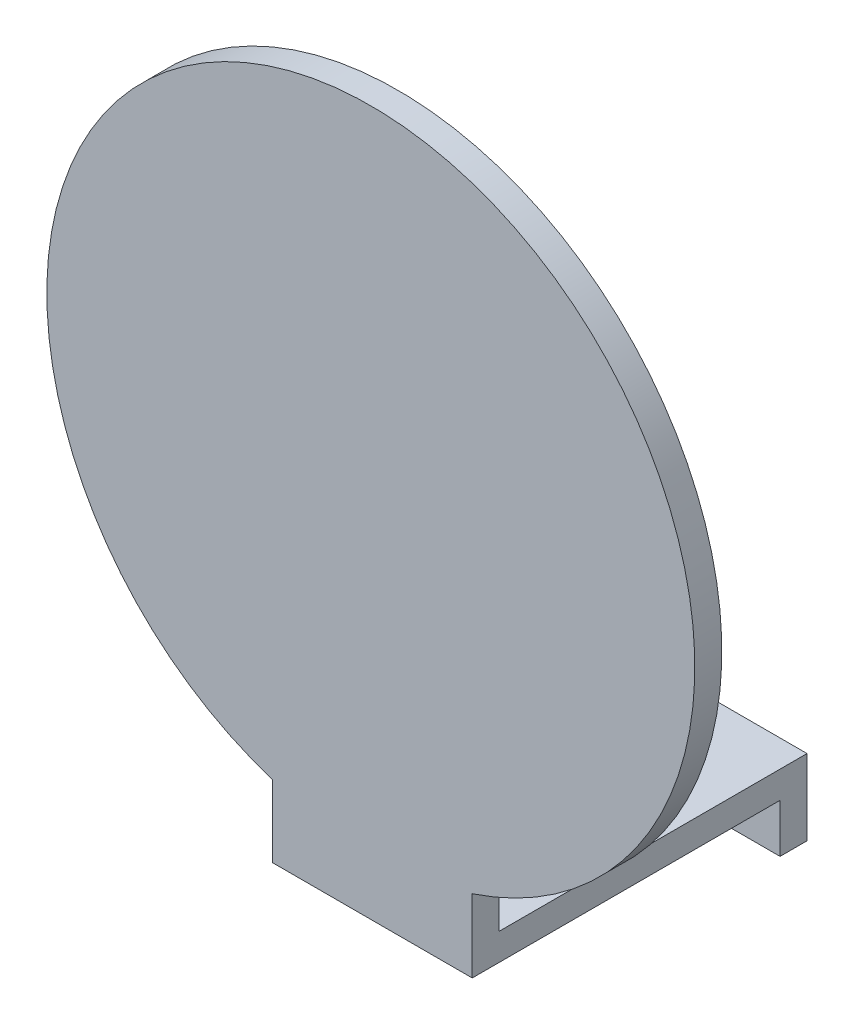
ISO-10303-21;
HEADER;
FILE_DESCRIPTION(('STEP AP214'),'2;1');
FILE_NAME('part.step','',(''),(''),'','','');
FILE_SCHEMA(('AUTOMOTIVE_DESIGN { 1 0 10303 214 1 1 1 1 }'));
ENDSEC;
DATA;
#1=APPLICATION_CONTEXT('core data for automotive mechanical design processes');
#2=APPLICATION_PROTOCOL_DEFINITION('international standard','automotive_design',2000,#1);
#3=PRODUCT_CONTEXT('',#1,'mechanical');
#4=PRODUCT('Part','Part','',(#3));
#5=PRODUCT_RELATED_PRODUCT_CATEGORY('part','',(#4));
#6=PRODUCT_DEFINITION_FORMATION('','',#4);
#7=PRODUCT_DEFINITION_CONTEXT('part definition',#1,'design');
#8=PRODUCT_DEFINITION('design','',#6,#7);
#9=PRODUCT_DEFINITION_SHAPE('','',#8);
#10=(LENGTH_UNIT() NAMED_UNIT(*) SI_UNIT(.MILLI.,.METRE.));
#11=(NAMED_UNIT(*) PLANE_ANGLE_UNIT() SI_UNIT($,.RADIAN.));
#12=(NAMED_UNIT(*) SI_UNIT($,.STERADIAN.) SOLID_ANGLE_UNIT());
#13=UNCERTAINTY_MEASURE_WITH_UNIT(LENGTH_MEASURE(1.E-05),#10,'distance_accuracy_value','');
#14=(GEOMETRIC_REPRESENTATION_CONTEXT(3) GLOBAL_UNCERTAINTY_ASSIGNED_CONTEXT((#13)) GLOBAL_UNIT_ASSIGNED_CONTEXT((#10,
#11,#12)) REPRESENTATION_CONTEXT('',''));
#15=CARTESIAN_POINT('',(0.,0.,0.));
#16=DIRECTION('',(0.,0.,1.));
#17=DIRECTION('',(1.,0.,0.));
#18=AXIS2_PLACEMENT_3D('',#15,#16,#17);
#19=CARTESIAN_POINT('',(0.,0.,-2342.01832557801));
#20=DIRECTION('',(0.,0.,1.));
#21=DIRECTION('',(1.,0.,0.));
#22=AXIS2_PLACEMENT_3D('',#19,#20,#21);
#23=PLANE('',#22);
#24=DIRECTION('',(1.,0.,0.));
#25=VECTOR('',#24,1.);
#26=CARTESIAN_POINT('',(18.4999999999997,6.00000000000043,-2342.01832557801));
#27=LINE('',#26,#25);
#28=CARTESIAN_POINT('',(-18.5000000000004,6.00000000000043,-2342.01832557801));
#29=VERTEX_POINT('',#28);
#30=CARTESIAN_POINT('',(18.4999999999997,6.00000000000043,-2342.01832557801));
#31=VERTEX_POINT('',#30);
#32=EDGE_CURVE('E125',#29,#31,#27,.T.);
#33=ORIENTED_EDGE('',*,*,#32,.F.);
#34=DIRECTION('',(0.,-1.,0.));
#35=VECTOR('',#34,1.);
#36=CARTESIAN_POINT('',(-18.5000000000004,5.00000000000019,-2342.01832557801));
#37=LINE('',#36,#35);
#38=CARTESIAN_POINT('',(-18.5000000000004,-2.99999999999977,-2342.01832557801));
#39=VERTEX_POINT('',#38);
#40=EDGE_CURVE('E154',#29,#39,#37,.T.);
#41=ORIENTED_EDGE('',*,*,#40,.T.);
#42=DIRECTION('',(1.,0.,0.));
#43=VECTOR('',#42,1.);
#44=CARTESIAN_POINT('',(-18.5000000000004,-2.99999999999977,-2342.01832557801));
#45=LINE('',#44,#43);
#46=CARTESIAN_POINT('',(18.4999999999996,-2.99999999999977,-2342.01832557801));
#47=VERTEX_POINT('',#46);
#48=EDGE_CURVE('E156',#39,#47,#45,.T.);
#49=ORIENTED_EDGE('',*,*,#48,.T.);
#50=DIRECTION('',(0.,1.,0.));
#51=VECTOR('',#50,1.);
#52=CARTESIAN_POINT('',(18.4999999999996,5.00000000000019,-2342.01832557801));
#53=LINE('',#52,#51);
#54=EDGE_CURVE('E159',#47,#31,#53,.T.);
#55=ORIENTED_EDGE('',*,*,#54,.T.);
#56=EDGE_LOOP('',(#33,#41,#49,#55));
#57=FACE_BOUND('',#56,.T.);
#58=CARTESIAN_POINT('',(9.99999999999957,1.0000000000002,-2342.01832557801));
#59=DIRECTION('',(0.,0.,1.));
#60=DIRECTION('',(1.,0.,0.));
#61=AXIS2_PLACEMENT_3D('',#58,#59,#60);
#62=CIRCLE('',#61,2.1);
#63=CARTESIAN_POINT('',(12.0999999999996,1.0000000000002,-2342.01832557801));
#64=VERTEX_POINT('',#63);
#65=EDGE_CURVE('E148',#64,#64,#62,.T.);
#66=ORIENTED_EDGE('',*,*,#65,.F.);
#67=EDGE_LOOP('',(#66));
#68=FACE_BOUND('',#67,.T.);
#69=CARTESIAN_POINT('',(-10.0000000000004,1.00000000000023,-2342.01832557801));
#70=DIRECTION('',(0.,0.,1.));
#71=DIRECTION('',(1.,0.,0.));
#72=AXIS2_PLACEMENT_3D('',#69,#70,#71);
#73=CIRCLE('',#72,2.1);
#74=CARTESIAN_POINT('',(-7.90000000000042,1.00000000000023,-2342.01832557801));
#75=VERTEX_POINT('',#74);
#76=EDGE_CURVE('E142',#75,#75,#73,.T.);
#77=ORIENTED_EDGE('',*,*,#76,.F.);
#78=EDGE_LOOP('',(#77));
#79=FACE_BOUND('',#78,.T.);
#80=ADVANCED_FACE('F33',(#57,#68,#79),#23,.T.);
#81=CARTESIAN_POINT('',(0.,0.,-2347.01832557801));
#82=DIRECTION('',(0.,0.,1.));
#83=DIRECTION('',(1.,0.,0.));
#84=AXIS2_PLACEMENT_3D('',#81,#82,#83);
#85=PLANE('',#84);
#86=DIRECTION('',(0.,-1.,0.));
#87=VECTOR('',#86,1.);
#88=CARTESIAN_POINT('',(-18.5000000000004,5.00000000000019,-2347.01832557801));
#89=LINE('',#88,#87);
#90=CARTESIAN_POINT('',(-18.5000000000004,11.0000000000002,-2347.01832557801));
#91=VERTEX_POINT('',#90);
#92=CARTESIAN_POINT('',(-18.5000000000004,-2.99999999999977,-2347.01832557801));
#93=VERTEX_POINT('',#92);
#94=EDGE_CURVE('E151',#91,#93,#89,.T.);
#95=ORIENTED_EDGE('',*,*,#94,.F.);
#96=DIRECTION('',(-1.,0.,0.));
#97=VECTOR('',#96,1.);
#98=CARTESIAN_POINT('',(18.4999999999996,11.0000000000002,-2347.01832557801));
#99=LINE('',#98,#97);
#100=CARTESIAN_POINT('',(18.4999999999996,11.0000000000002,-2347.01832557801));
#101=VERTEX_POINT('',#100);
#102=EDGE_CURVE('E116',#101,#91,#99,.T.);
#103=ORIENTED_EDGE('',*,*,#102,.F.);
#104=DIRECTION('',(0.,1.,0.));
#105=VECTOR('',#104,1.);
#106=CARTESIAN_POINT('',(18.4999999999996,5.00000000000019,-2347.01832557801));
#107=LINE('',#106,#105);
#108=CARTESIAN_POINT('',(18.4999999999996,-2.99999999999977,-2347.01832557801));
#109=VERTEX_POINT('',#108);
#110=EDGE_CURVE('E157',#109,#101,#107,.T.);
#111=ORIENTED_EDGE('',*,*,#110,.F.);
#112=DIRECTION('',(1.,0.,0.));
#113=VECTOR('',#112,1.);
#114=CARTESIAN_POINT('',(-18.5000000000004,-2.99999999999977,-2347.01832557801));
#115=LINE('',#114,#113);
#116=EDGE_CURVE('E162',#93,#109,#115,.T.);
#117=ORIENTED_EDGE('',*,*,#116,.F.);
#118=EDGE_LOOP('',(#95,#103,#111,#117));
#119=FACE_BOUND('',#118,.T.);
#120=CARTESIAN_POINT('',(9.99999999999957,1.0000000000002,-2347.01832557801));
#121=DIRECTION('',(0.,0.,1.));
#122=DIRECTION('',(1.,0.,0.));
#123=AXIS2_PLACEMENT_3D('',#120,#121,#122);
#124=CIRCLE('',#123,2.1);
#125=CARTESIAN_POINT('',(12.0999999999996,1.0000000000002,-2347.01832557801));
#126=VERTEX_POINT('',#125);
#127=EDGE_CURVE('E145',#126,#126,#124,.T.);
#128=ORIENTED_EDGE('',*,*,#127,.T.);
#129=EDGE_LOOP('',(#128));
#130=FACE_BOUND('',#129,.T.);
#131=CARTESIAN_POINT('',(-10.0000000000004,1.00000000000023,-2347.01832557801));
#132=DIRECTION('',(0.,0.,1.));
#133=DIRECTION('',(1.,0.,0.));
#134=AXIS2_PLACEMENT_3D('',#131,#132,#133);
#135=CIRCLE('',#134,2.1);
#136=CARTESIAN_POINT('',(-7.90000000000042,1.00000000000023,-2347.01832557801));
#137=VERTEX_POINT('',#136);
#138=EDGE_CURVE('E117',#137,#137,#135,.T.);
#139=ORIENTED_EDGE('',*,*,#138,.T.);
#140=EDGE_LOOP('',(#139));
#141=FACE_BOUND('',#140,.T.);
#142=ADVANCED_FACE('F173',(#119,#130,#141),#85,.F.);
#143=CARTESIAN_POINT('',(-18.5000000000004,5.00000000000019,-2342.01832557801));
#144=DIRECTION('',(1.,0.,0.));
#145=DIRECTION('',(0.,0.,-1.));
#146=AXIS2_PLACEMENT_3D('',#143,#144,#145);
#147=PLANE('',#146);
#148=DIRECTION('',(0.,-1.,0.));
#149=VECTOR('',#148,1.);
#150=CARTESIAN_POINT('',(-18.5000000000003,11.0000000000004,-2285.01832557801));
#151=LINE('',#150,#149);
#152=CARTESIAN_POINT('',(-18.5000000000003,19.3334810038366,-2285.01832557801));
#153=VERTEX_POINT('',#152);
#154=CARTESIAN_POINT('',(-18.5000000000003,6.00000000000043,-2285.01832557801));
#155=VERTEX_POINT('',#154);
#156=EDGE_CURVE('E48',#153,#155,#151,.T.);
#157=ORIENTED_EDGE('',*,*,#156,.F.);
#158=DIRECTION('',(0.,0.,1.));
#159=VECTOR('',#158,1.);
#160=CARTESIAN_POINT('',(-18.5000000000004,19.3334810038366,-2290.01832557801));
#161=LINE('',#160,#159);
#162=CARTESIAN_POINT('',(-18.5000000000004,19.3334810038366,-2290.01832557801));
#163=VERTEX_POINT('',#162);
#164=EDGE_CURVE('E102',#153,#163,#161,.F.);
#165=ORIENTED_EDGE('',*,*,#164,.T.);
#166=DIRECTION('',(0.,-1.,0.));
#167=VECTOR('',#166,1.);
#168=CARTESIAN_POINT('',(-18.5000000000004,38.5000000000002,-2290.01832557801));
#169=LINE('',#168,#167);
#170=CARTESIAN_POINT('',(-18.5000000000004,11.0000000000002,-2290.01832557801));
#171=VERTEX_POINT('',#170);
#172=EDGE_CURVE('E98',#163,#171,#169,.T.);
#173=ORIENTED_EDGE('',*,*,#172,.T.);
#174=DIRECTION('',(0.,0.,1.));
#175=VECTOR('',#174,1.);
#176=CARTESIAN_POINT('',(-18.5000000000004,11.0000000000002,-2342.01832557801));
#177=LINE('',#176,#175);
#178=EDGE_CURVE('E101',#91,#171,#177,.T.);
#179=ORIENTED_EDGE('',*,*,#178,.F.);
#180=ORIENTED_EDGE('',*,*,#94,.T.);
#181=DIRECTION('',(0.,0.,-1.));
#182=VECTOR('',#181,1.);
#183=CARTESIAN_POINT('',(-18.5000000000004,-2.99999999999977,-2342.01832557801));
#184=LINE('',#183,#182);
#185=EDGE_CURVE('E11',#39,#93,#184,.T.);
#186=ORIENTED_EDGE('',*,*,#185,.F.);
#187=ORIENTED_EDGE('',*,*,#40,.F.);
#188=DIRECTION('',(0.,0.,-1.));
#189=VECTOR('',#188,1.);
#190=CARTESIAN_POINT('',(-18.5000000000003,6.00000000000043,-2285.01832557801));
#191=LINE('',#190,#189);
#192=EDGE_CURVE('E136',#155,#29,#191,.T.);
#193=ORIENTED_EDGE('',*,*,#192,.F.);
#194=EDGE_LOOP('',(#157,#165,#173,#179,#180,#186,#187,#193));
#195=FACE_BOUND('',#194,.T.);
#196=ADVANCED_FACE('F35',(#195),#147,.F.);
#197=CARTESIAN_POINT('',(-18.5000000000004,-2.99999999999977,-2342.01832557801));
#198=DIRECTION('',(0.,1.,0.));
#199=DIRECTION('',(-1.,0.,0.));
#200=AXIS2_PLACEMENT_3D('',#197,#198,#199);
#201=PLANE('',#200);
#202=ORIENTED_EDGE('',*,*,#116,.T.);
#203=DIRECTION('',(0.,0.,-1.));
#204=VECTOR('',#203,1.);
#205=CARTESIAN_POINT('',(18.4999999999996,-2.99999999999977,-2342.01832557801));
#206=LINE('',#205,#204);
#207=EDGE_CURVE('E41',#47,#109,#206,.T.);
#208=ORIENTED_EDGE('',*,*,#207,.F.);
#209=ORIENTED_EDGE('',*,*,#48,.F.);
#210=ORIENTED_EDGE('',*,*,#185,.T.);
#211=EDGE_LOOP('',(#202,#208,#209,#210));
#212=FACE_BOUND('',#211,.T.);
#213=ADVANCED_FACE('F177',(#212),#201,.F.);
#214=CARTESIAN_POINT('',(18.4999999999996,5.00000000000019,-2342.01832557801));
#215=DIRECTION('',(-1.,0.,0.));
#216=DIRECTION('',(0.,0.,1.));
#217=AXIS2_PLACEMENT_3D('',#214,#215,#216);
#218=PLANE('',#217);
#219=DIRECTION('',(0.,-1.,0.));
#220=VECTOR('',#219,1.);
#221=CARTESIAN_POINT('',(18.4999999999997,38.5000000000002,-2290.01832557801));
#222=LINE('',#221,#220);
#223=CARTESIAN_POINT('',(18.4999999999997,19.5146251954965,-2290.01832557801));
#224=VERTEX_POINT('',#223);
#225=CARTESIAN_POINT('',(18.4999999999996,11.0000000000002,-2290.01832557801));
#226=VERTEX_POINT('',#225);
#227=EDGE_CURVE('E107',#224,#226,#222,.T.);
#228=ORIENTED_EDGE('',*,*,#227,.F.);
#229=DIRECTION('',(0.,0.,1.));
#230=VECTOR('',#229,1.);
#231=CARTESIAN_POINT('',(18.4999999999996,19.5146251954965,-2290.01832557801));
#232=LINE('',#231,#230);
#233=CARTESIAN_POINT('',(18.4999999999997,19.5146251954965,-2285.01832557801));
#234=VERTEX_POINT('',#233);
#235=EDGE_CURVE('E56',#224,#234,#232,.T.);
#236=ORIENTED_EDGE('',*,*,#235,.T.);
#237=DIRECTION('',(0.,1.,0.));
#238=VECTOR('',#237,1.);
#239=CARTESIAN_POINT('',(18.4999999999997,11.0000000000004,-2285.01832557801));
#240=LINE('',#239,#238);
#241=CARTESIAN_POINT('',(18.4999999999997,6.00000000000043,-2285.01832557801));
#242=VERTEX_POINT('',#241);
#243=EDGE_CURVE('E126',#242,#234,#240,.T.);
#244=ORIENTED_EDGE('',*,*,#243,.F.);
#245=DIRECTION('',(0.,0.,-1.));
#246=VECTOR('',#245,1.);
#247=CARTESIAN_POINT('',(18.4999999999997,6.00000000000043,-2285.01832557801));
#248=LINE('',#247,#246);
#249=EDGE_CURVE('E131',#242,#31,#248,.T.);
#250=ORIENTED_EDGE('',*,*,#249,.T.);
#251=ORIENTED_EDGE('',*,*,#54,.F.);
#252=ORIENTED_EDGE('',*,*,#207,.T.);
#253=ORIENTED_EDGE('',*,*,#110,.T.);
#254=DIRECTION('',(0.,0.,-1.));
#255=VECTOR('',#254,1.);
#256=CARTESIAN_POINT('',(18.4999999999996,11.0000000000002,-2342.01832557801));
#257=LINE('',#256,#255);
#258=EDGE_CURVE('E139',#226,#101,#257,.T.);
#259=ORIENTED_EDGE('',*,*,#258,.F.);
#260=EDGE_LOOP('',(#228,#236,#244,#250,#251,#252,#253,#259));
#261=FACE_BOUND('',#260,.T.);
#262=ADVANCED_FACE('F169',(#261),#218,.F.);
#263=CARTESIAN_POINT('',(9.99999999999957,1.0000000000002,-2342.01832557801));
#264=DIRECTION('',(0.,0.,-1.));
#265=DIRECTION('',(-1.,0.,0.));
#266=AXIS2_PLACEMENT_3D('',#263,#264,#265);
#267=CYLINDRICAL_SURFACE('',#266,2.1);
#268=ORIENTED_EDGE('',*,*,#65,.T.);
#269=EDGE_LOOP('',(#268));
#270=FACE_BOUND('',#269,.T.);
#271=ORIENTED_EDGE('',*,*,#127,.F.);
#272=EDGE_LOOP('',(#271));
#273=FACE_BOUND('',#272,.T.);
#274=ADVANCED_FACE('F207',(#270,#273),#267,.F.);
#275=CARTESIAN_POINT('',(-10.0000000000004,1.00000000000023,-2342.01832557801));
#276=DIRECTION('',(0.,0.,-1.));
#277=DIRECTION('',(-1.,0.,0.));
#278=AXIS2_PLACEMENT_3D('',#275,#276,#277);
#279=CYLINDRICAL_SURFACE('',#278,2.1);
#280=ORIENTED_EDGE('',*,*,#76,.T.);
#281=EDGE_LOOP('',(#280));
#282=FACE_BOUND('',#281,.T.);
#283=ORIENTED_EDGE('',*,*,#138,.F.);
#284=EDGE_LOOP('',(#283));
#285=FACE_BOUND('',#284,.T.);
#286=ADVANCED_FACE('F231',(#282,#285),#279,.F.);
#287=CARTESIAN_POINT('',(0.,11.0000000000002,0.));
#288=DIRECTION('',(0.,1.,0.));
#289=DIRECTION('',(-1.,0.,0.));
#290=AXIS2_PLACEMENT_3D('',#287,#288,#289);
#291=PLANE('',#290);
#292=DIRECTION('',(-1.,0.,0.));
#293=VECTOR('',#292,1.);
#294=CARTESIAN_POINT('',(18.4999999999997,11.0000000000002,-2290.01832557801));
#295=LINE('',#294,#293);
#296=EDGE_CURVE('E108',#226,#171,#295,.T.);
#297=ORIENTED_EDGE('',*,*,#296,.F.);
#298=ORIENTED_EDGE('',*,*,#258,.T.);
#299=ORIENTED_EDGE('',*,*,#102,.T.);
#300=ORIENTED_EDGE('',*,*,#178,.T.);
#301=EDGE_LOOP('',(#297,#298,#299,#300));
#302=FACE_BOUND('',#301,.T.);
#303=ADVANCED_FACE('F113',(#302),#291,.T.);
#304=CARTESIAN_POINT('',(18.4999999999997,6.00000000000043,-2285.01832557801));
#305=DIRECTION('',(0.,1.,0.));
#306=DIRECTION('',(-1.,0.,0.));
#307=AXIS2_PLACEMENT_3D('',#304,#305,#306);
#308=PLANE('',#307);
#309=ORIENTED_EDGE('',*,*,#32,.T.);
#310=ORIENTED_EDGE('',*,*,#249,.F.);
#311=DIRECTION('',(1.,0.,0.));
#312=VECTOR('',#311,1.);
#313=CARTESIAN_POINT('',(18.4999999999997,6.00000000000043,-2285.01832557801));
#314=LINE('',#313,#312);
#315=EDGE_CURVE('E129',#155,#242,#314,.T.);
#316=ORIENTED_EDGE('',*,*,#315,.F.);
#317=ORIENTED_EDGE('',*,*,#192,.T.);
#318=EDGE_LOOP('',(#309,#310,#316,#317));
#319=FACE_BOUND('',#318,.T.);
#320=ADVANCED_FACE('F182',(#319),#308,.F.);
#321=CARTESIAN_POINT('',(0.,0.,-2285.01832557801));
#322=DIRECTION('',(0.,0.,-1.));
#323=DIRECTION('',(-1.,0.,0.));
#324=AXIS2_PLACEMENT_3D('',#321,#322,#323);
#325=PLANE('',#324);
#326=CARTESIAN_POINT('',(-0.279431790932432,76.5,-2285.01832557801));
#327=DIRECTION('',(0.,0.,1.));
#328=DIRECTION('',(1.,0.,0.));
#329=AXIS2_PLACEMENT_3D('',#326,#327,#328);
#330=CIRCLE('',#329,60.0000000000001);
#331=EDGE_CURVE('E188',#234,#153,#330,.T.);
#332=ORIENTED_EDGE('',*,*,#331,.T.);
#333=ORIENTED_EDGE('',*,*,#156,.T.);
#334=ORIENTED_EDGE('',*,*,#315,.T.);
#335=ORIENTED_EDGE('',*,*,#243,.T.);
#336=EDGE_LOOP('',(#332,#333,#334,#335));
#337=FACE_BOUND('',#336,.T.);
#338=ADVANCED_FACE('F187',(#337),#325,.F.);
#339=CARTESIAN_POINT('',(18.4999999999997,38.5000000000002,-2290.01832557801));
#340=DIRECTION('',(0.,0.,1.));
#341=DIRECTION('',(1.,0.,0.));
#342=AXIS2_PLACEMENT_3D('',#339,#340,#341);
#343=PLANE('',#342);
#344=ORIENTED_EDGE('',*,*,#172,.F.);
#345=CARTESIAN_POINT('',(-0.279431790932432,76.5,-2290.01832557801));
#346=DIRECTION('',(0.,0.,1.));
#347=DIRECTION('',(1.,0.,0.));
#348=AXIS2_PLACEMENT_3D('',#345,#346,#347);
#349=CIRCLE('',#348,60.0000000000001);
#350=EDGE_CURVE('E191',#224,#163,#349,.T.);
#351=ORIENTED_EDGE('',*,*,#350,.F.);
#352=ORIENTED_EDGE('',*,*,#227,.T.);
#353=ORIENTED_EDGE('',*,*,#296,.T.);
#354=EDGE_LOOP('',(#344,#351,#352,#353));
#355=FACE_BOUND('',#354,.T.);
#356=ADVANCED_FACE('F119',(#355),#343,.F.);
#357=CARTESIAN_POINT('',(-0.279431790932432,76.5,-2290.01832557801));
#358=DIRECTION('',(0.,0.,1.));
#359=DIRECTION('',(1.,0.,0.));
#360=AXIS2_PLACEMENT_3D('',#357,#358,#359);
#361=CYLINDRICAL_SURFACE('',#360,60.0000000000001);
#362=ORIENTED_EDGE('',*,*,#164,.F.);
#363=ORIENTED_EDGE('',*,*,#331,.F.);
#364=ORIENTED_EDGE('',*,*,#235,.F.);
#365=ORIENTED_EDGE('',*,*,#350,.T.);
#366=EDGE_LOOP('',(#362,#363,#364,#365));
#367=FACE_BOUND('',#366,.T.);
#368=ADVANCED_FACE('F190',(#367),#361,.T.);
#369=CLOSED_SHELL('',(#80,#142,#196,#213,#262,#274,#286,#303,#320,#338,#356,#368));
#370=MANIFOLD_SOLID_BREP('B2',#369);
#371=ADVANCED_BREP_SHAPE_REPRESENTATION('',(#18,#370),#14);
#372=SHAPE_DEFINITION_REPRESENTATION(#9,#371);
ENDSEC;
END-ISO-10303-21;
